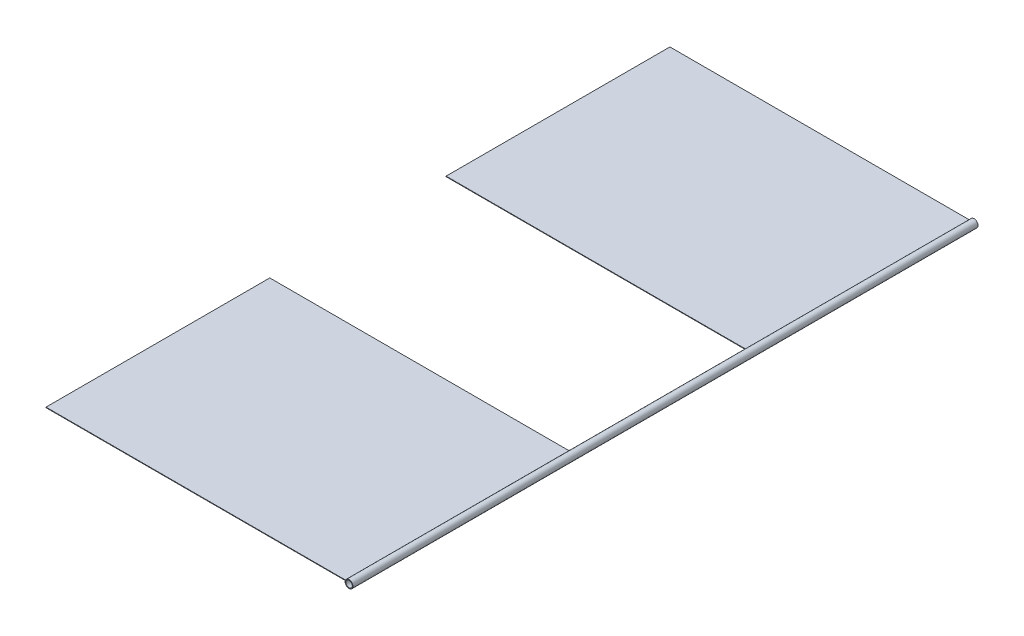
ISO-10303-21;
HEADER;
FILE_DESCRIPTION(('STEP AP214'),'2;1');
FILE_NAME('part.step','',(''),(''),'','','');
FILE_SCHEMA(('AUTOMOTIVE_DESIGN { 1 0 10303 214 1 1 1 1 }'));
ENDSEC;
DATA;
#1=APPLICATION_CONTEXT('core data for automotive mechanical design processes');
#2=APPLICATION_PROTOCOL_DEFINITION('international standard','automotive_design',2000,#1);
#3=PRODUCT_CONTEXT('',#1,'mechanical');
#4=PRODUCT('Part','Part','',(#3));
#5=PRODUCT_RELATED_PRODUCT_CATEGORY('part','',(#4));
#6=PRODUCT_DEFINITION_FORMATION('','',#4);
#7=PRODUCT_DEFINITION_CONTEXT('part definition',#1,'design');
#8=PRODUCT_DEFINITION('design','',#6,#7);
#9=PRODUCT_DEFINITION_SHAPE('','',#8);
#10=(LENGTH_UNIT() NAMED_UNIT(*) SI_UNIT(.MILLI.,.METRE.));
#11=(NAMED_UNIT(*) PLANE_ANGLE_UNIT() SI_UNIT($,.RADIAN.));
#12=(NAMED_UNIT(*) SI_UNIT($,.STERADIAN.) SOLID_ANGLE_UNIT());
#13=UNCERTAINTY_MEASURE_WITH_UNIT(LENGTH_MEASURE(1.E-05),#10,'distance_accuracy_value','');
#14=(GEOMETRIC_REPRESENTATION_CONTEXT(3) GLOBAL_UNCERTAINTY_ASSIGNED_CONTEXT((#13)) GLOBAL_UNIT_ASSIGNED_CONTEXT((#10,
#11,#12)) REPRESENTATION_CONTEXT('',''));
#15=CARTESIAN_POINT('',(0.,0.,0.));
#16=DIRECTION('',(0.,0.,1.));
#17=DIRECTION('',(1.,0.,0.));
#18=AXIS2_PLACEMENT_3D('',#15,#16,#17);
#19=CARTESIAN_POINT('',(0.,0.,3048.));
#20=DIRECTION('',(0.,0.,-1.));
#21=DIRECTION('',(-1.,0.,0.));
#22=AXIS2_PLACEMENT_3D('',#19,#20,#21);
#23=CYLINDRICAL_SURFACE('',#22,19.05);
#24=CARTESIAN_POINT('',(0.,0.,1951.07937136251));
#25=DIRECTION('',(0.,0.,1.));
#26=DIRECTION('',(1.,0.,0.));
#27=AXIS2_PLACEMENT_3D('',#24,#25,#26);
#28=CIRCLE('',#27,19.05);
#29=CARTESIAN_POINT('',(-18.8799073090945,2.54,1951.07937136251));
#30=VERTEX_POINT('',#29);
#31=CARTESIAN_POINT('',(-19.05,0.,1951.07937136251));
#32=VERTEX_POINT('',#31);
#33=EDGE_CURVE('E46',#30,#32,#28,.T.);
#34=ORIENTED_EDGE('',*,*,#33,.F.);
#35=DIRECTION('',(0.,0.,-1.));
#36=VECTOR('',#35,1.);
#37=CARTESIAN_POINT('',(-18.8799073090945,2.54,3048.));
#38=LINE('',#37,#36);
#39=CARTESIAN_POINT('',(-18.8799073090945,2.54,3042.28919320611));
#40=VERTEX_POINT('',#39);
#41=EDGE_CURVE('E11',#30,#40,#38,.F.);
#42=ORIENTED_EDGE('',*,*,#41,.T.);
#43=CARTESIAN_POINT('',(0.,0.,3042.28919320611));
#44=DIRECTION('',(0.,0.,-1.));
#45=DIRECTION('',(-1.,0.,0.));
#46=AXIS2_PLACEMENT_3D('',#43,#44,#45);
#47=CIRCLE('',#46,19.05);
#48=CARTESIAN_POINT('',(-19.05,0.,3042.28919320611));
#49=VERTEX_POINT('',#48);
#50=EDGE_CURVE('E127',#49,#40,#47,.T.);
#51=ORIENTED_EDGE('',*,*,#50,.F.);
#52=DIRECTION('',(0.,0.,-1.));
#53=VECTOR('',#52,1.);
#54=CARTESIAN_POINT('',(-19.05,0.,3048.));
#55=LINE('',#54,#53);
#56=EDGE_CURVE('E109',#32,#49,#55,.F.);
#57=ORIENTED_EDGE('',*,*,#56,.F.);
#58=EDGE_LOOP('',(#34,#42,#51,#57));
#59=FACE_BOUND('',#58,.T.);
#60=CARTESIAN_POINT('',(0.,0.,3048.));
#61=DIRECTION('',(0.,0.,1.));
#62=DIRECTION('',(1.,0.,0.));
#63=AXIS2_PLACEMENT_3D('',#60,#61,#62);
#64=CIRCLE('',#63,19.05);
#65=CARTESIAN_POINT('',(19.05,0.,3048.));
#66=VERTEX_POINT('',#65);
#67=EDGE_CURVE('E187',#66,#66,#64,.T.);
#68=ORIENTED_EDGE('',*,*,#67,.F.);
#69=EDGE_LOOP('',(#68));
#70=FACE_BOUND('',#69,.T.);
#71=CARTESIAN_POINT('',(-19.05,0.,1816.1));
#72=CARTESIAN_POINT('',(-19.0499999149557,0.319044351827431,1816.10000008211));
#73=CARTESIAN_POINT('',(-19.041968060588,0.638090286445415,1816.11203839982));
#74=CARTESIAN_POINT('',(-19.0100429113742,1.27357416889368,1816.16000197035));
#75=CARTESIAN_POINT('',(-18.9861495330445,1.59001210298844,1816.19592734888));
#76=CARTESIAN_POINT('',(-18.9230795112656,2.21792085178077,1816.29113481668));
#77=CARTESIAN_POINT('',(-18.8838969102271,2.52938968091534,1816.35042601075));
#78=CARTESIAN_POINT('',(-18.7911802647186,3.14498780586517,1816.49151590429));
#79=CARTESIAN_POINT('',(-18.7376460467142,3.44911701288401,1816.57331487591));
#80=CARTESIAN_POINT('',(-18.6177206611583,4.0466538013402,1816.75791049455));
#81=CARTESIAN_POINT('',(-18.551392136999,4.34010566223847,1816.86060496236));
#82=CARTESIAN_POINT('',(-18.4071052568794,4.9162149019322,1817.08605426698));
#83=CARTESIAN_POINT('',(-18.3291469610881,5.19887233656531,1817.20880900001));
#84=CARTESIAN_POINT('',(-18.1631367051315,5.7520743270185,1817.47314642421));
#85=CARTESIAN_POINT('',(-18.0750863641369,6.02262081626361,1817.61472609567));
#86=CARTESIAN_POINT('',(-17.890458352108,6.55074759818103,1817.91560225436));
#87=CARTESIAN_POINT('',(-17.7938775100723,6.80832301284097,1818.07490533558));
#88=CARTESIAN_POINT('',(-17.5854082661757,7.33086574145439,1818.42428914995));
#89=CARTESIAN_POINT('',(-17.4729161377666,7.59461321173181,1818.61583369295));
#90=CARTESIAN_POINT('',(-17.2420675803483,8.1050653025782,1819.01719120944));
#91=CARTESIAN_POINT('',(-17.1237109886304,8.35176944982761,1819.22700468992));
#92=CARTESIAN_POINT('',(-16.88319928241,8.82787123192332,1819.6641752971));
#93=CARTESIAN_POINT('',(-16.761038834922,9.05724286741385,1819.89155778368));
#94=CARTESIAN_POINT('',(-16.5154631225223,9.49765992068974,1820.36267666605));
#95=CARTESIAN_POINT('',(-16.3920481088713,9.7087089303321,1820.60640983986));
#96=CARTESIAN_POINT('',(-16.1269912795643,10.1438339769355,1821.14937546016));
#97=CARTESIAN_POINT('',(-15.9855513078686,10.3646977289021,1821.45129146347));
#98=CARTESIAN_POINT('',(-15.7084356410374,10.780069739996,1822.07537173626));
#99=CARTESIAN_POINT('',(-15.5727612595664,10.9745720146432,1822.39754057923));
#100=CARTESIAN_POINT('',(-15.3120771580104,11.3354426882506,1823.06066201176));
#101=CARTESIAN_POINT('',(-15.1870504300321,11.5018563882181,1823.401583157));
#102=CARTESIAN_POINT('',(-14.9525421661918,11.8051159191697,1824.1016331048));
#103=CARTESIAN_POINT('',(-14.8430611914587,11.9419606829467,1824.46076256395));
#104=CARTESIAN_POINT('',(-14.6737887971172,12.1488590280839,1825.08909158887));
#105=CARTESIAN_POINT('',(-14.6087779778263,12.2267886352653,1825.354312724));
#106=CARTESIAN_POINT('',(-14.4914306450492,12.365646341897,1825.8917796618));
#107=CARTESIAN_POINT('',(-14.4390859954183,12.4265853591446,1826.16402083011));
#108=CARTESIAN_POINT('',(-14.3488945218811,12.5306215699127,1826.71392215595));
#109=CARTESIAN_POINT('',(-14.3110297415314,12.5737408670082,1826.99157515004));
#110=CARTESIAN_POINT('',(-14.2511622433024,12.6415558604092,1827.55084231658));
#111=CARTESIAN_POINT('',(-14.2291596123525,12.6662514557472,1827.83245651072));
#112=CARTESIAN_POINT('',(-14.2018752005734,12.6968370696705,1828.39869661561));
#113=CARTESIAN_POINT('',(-14.196663038368,12.7026487905647,1828.68333016881));
#114=CARTESIAN_POINT('',(-14.2033816794799,12.6951357599989,1829.25213953647));
#115=CARTESIAN_POINT('',(-14.2153125410288,12.6818109435355,1829.53631534939));
#116=CARTESIAN_POINT('',(-14.2558189324114,12.6362591370599,1830.10214668239));
#117=CARTESIAN_POINT('',(-14.2844068298006,12.604018101965,1830.38380017175));
#118=CARTESIAN_POINT('',(-14.357069745187,12.5211847753434,1830.94234802377));
#119=CARTESIAN_POINT('',(-14.4011450585548,12.4705921338209,1831.21924229556));
#120=CARTESIAN_POINT('',(-14.5008617434375,12.3544761806585,1831.75440977541));
#121=CARTESIAN_POINT('',(-14.55590095007,12.289717714774,1832.012963225));
#122=CARTESIAN_POINT('',(-14.6769594426604,12.1448862980871,1832.5231831653));
#123=CARTESIAN_POINT('',(-14.742982278044,12.0648083954581,1832.77484739901));
#124=CARTESIAN_POINT('',(-14.8842370446745,11.8901049878849,1833.27039533264));
#125=CARTESIAN_POINT('',(-14.9594690117088,11.7954794264067,1833.51427900232));
#126=CARTESIAN_POINT('',(-15.1173998256832,11.5923798373339,1833.99369955338));
#127=CARTESIAN_POINT('',(-15.2000989778942,11.4839052434926,1834.22923609297));
#128=CARTESIAN_POINT('',(-15.3887310058595,11.2302825549988,1834.73863252709));
#129=CARTESIAN_POINT('',(-15.4959665818437,11.0821640136152,1835.01053379024));
#130=CARTESIAN_POINT('',(-15.7161179031399,10.7676822582034,1835.54107683918));
#131=CARTESIAN_POINT('',(-15.829033070871,10.6013208973392,1835.79971996786));
#132=CARTESIAN_POINT('',(-16.058224949471,10.2508438822787,1836.3036322006));
#133=CARTESIAN_POINT('',(-16.1745055279823,10.0667071827702,1836.54888489974));
#134=CARTESIAN_POINT('',(-16.4080174089175,9.68143701029365,1837.02518161231));
#135=CARTESIAN_POINT('',(-16.525248774024,9.48030240833241,1837.25622468019));
#136=CARTESIAN_POINT('',(-16.7837163834045,9.01633250153971,1837.75178685886));
#137=CARTESIAN_POINT('',(-16.9246742415276,8.74954821141177,1838.01277245872));
#138=CARTESIAN_POINT('',(-17.2012588585807,8.192431898865,1838.51153228265));
#139=CARTESIAN_POINT('',(-17.3368846334085,7.90209555963253,1838.74930223387));
#140=CARTESIAN_POINT('',(-17.5992409697553,7.29912570388169,1839.19972408662));
#141=CARTESIAN_POINT('',(-17.7259780204629,6.98650879659969,1839.41239439117));
#142=CARTESIAN_POINT('',(-17.9673044475892,6.34014069602103,1839.81075092457));
#143=CARTESIAN_POINT('',(-18.0818971641011,6.00639535429019,1839.99644457811));
#144=CARTESIAN_POINT('',(-18.2747724322506,5.38691504029946,1840.30505585161));
#145=CARTESIAN_POINT('',(-18.3557696171759,5.10459086222116,1840.4331440072));
#146=CARTESIAN_POINT('',(-18.5062654001564,4.52870423339783,1840.66918833697));
#147=CARTESIAN_POINT('',(-18.5757661520493,4.23514390044705,1840.77714828262));
#148=CARTESIAN_POINT('',(-18.7017836207441,3.63850093619614,1840.9716760582));
#149=CARTESIAN_POINT('',(-18.7583086014464,3.33542450604288,1841.05825750616));
#150=CARTESIAN_POINT('',(-18.8571698991357,2.72145399464525,1841.209012769));
#151=CARTESIAN_POINT('',(-18.8995059978573,2.41055979322043,1841.27318623918));
#152=CARTESIAN_POINT('',(-18.9691377632047,1.78179294641308,1841.37844405422));
#153=CARTESIAN_POINT('',(-18.996366833584,1.46389572546418,1841.41942618037));
#154=CARTESIAN_POINT('',(-19.034820707395,0.824941145729784,1841.47723814078));
#155=CARTESIAN_POINT('',(-19.0460454899143,0.503883782815549,1841.49406794348));
#156=CARTESIAN_POINT('',(-19.0522045898932,-0.138725107609701,1841.50330710086));
#157=CARTESIAN_POINT('',(-19.0471395787862,-0.460276614207039,1841.49571746206));
#158=CARTESIAN_POINT('',(-19.0208492602128,-1.1012052955868,1841.45624053424));
#159=CARTESIAN_POINT('',(-18.9996246424728,-1.42058256258338,1841.42435428226));
#160=CARTESIAN_POINT('',(-18.9436003211899,-2.03226782020847,1841.3398728559));
#161=CARTESIAN_POINT('',(-18.9098612177052,-2.32489890402019,1841.28889319921));
#162=CARTESIAN_POINT('',(-18.8295982615719,-2.90417350057285,1841.16702766058));
#163=CARTESIAN_POINT('',(-18.7830751285297,-3.19081734935519,1841.09614289908));
#164=CARTESIAN_POINT('',(-18.6781723632704,-3.75647970570794,1840.93529307264));
#165=CARTESIAN_POINT('',(-18.6197919592089,-4.03549771553518,1840.84532676557));
#166=CARTESIAN_POINT('',(-18.4922798141389,-4.58448654730647,1840.64726353582));
#167=CARTESIAN_POINT('',(-18.4231475004616,-4.85445688642161,1840.53916564739));
#168=CARTESIAN_POINT('',(-18.2708860160937,-5.40020940820447,1840.29878017363));
#169=CARTESIAN_POINT('',(-18.1871630742087,-5.6753550346633,1840.16542477122));
#170=CARTESIAN_POINT('',(-18.0105704184075,-6.21304645580799,1839.88064192214));
#171=CARTESIAN_POINT('',(-17.9177004292694,-6.47559187101721,1839.72921393167));
#172=CARTESIAN_POINT('',(-17.7244005810023,-6.98734375229446,1839.40934136869));
#173=CARTESIAN_POINT('',(-17.6239673585762,-7.2365441986886,1839.24088921418));
#174=CARTESIAN_POINT('',(-17.4172474675303,-7.72083737411981,1838.88803517288));
#175=CARTESIAN_POINT('',(-17.3109601468281,-7.95592852541664,1838.70363150796));
#176=CARTESIAN_POINT('',(-17.0771108634958,-8.44749054584707,1838.28941008815));
#177=CARTESIAN_POINT('',(-16.9488424778651,-8.70146366391877,1838.05702204661));
#178=CARTESIAN_POINT('',(-16.6895134170716,-9.18906491102775,1837.57320222587));
#179=CARTESIAN_POINT('',(-16.5584523739017,-9.42269033781795,1837.32176792552));
#180=CARTESIAN_POINT('',(-16.2963694707964,-9.86903539048537,1836.80062047575));
#181=CARTESIAN_POINT('',(-16.1653476979282,-10.0817407099855,1836.53089502784));
#182=CARTESIAN_POINT('',(-15.9065761047636,-10.4852645071189,1835.97408053075));
#183=CARTESIAN_POINT('',(-15.7788259513027,-10.6760852203044,1835.68699325968));
#184=CARTESIAN_POINT('',(-15.5405469624032,-11.0197028233681,1835.12109654466));
#185=CARTESIAN_POINT('',(-15.4294753422067,-11.1743505461839,1834.84363978613));
#186=CARTESIAN_POINT('',(-15.2158323601735,-11.4635626931767,1834.27525270262));
#187=CARTESIAN_POINT('',(-15.1132611214873,-11.598126826412,1833.98432218252));
#188=CARTESIAN_POINT('',(-14.9199086044728,-11.8458215660013,1833.39020000616));
#189=CARTESIAN_POINT('',(-14.8291101392458,-11.9589835304227,1833.08702709072));
#190=CARTESIAN_POINT('',(-14.6624415509891,-12.1627572627768,1832.46920450079));
#191=CARTESIAN_POINT('',(-14.5865679980102,-12.2533742131333,1832.15455748297));
#192=CARTESIAN_POINT('',(-14.465008524996,-12.3964989415322,1831.57302325677));
#193=CARTESIAN_POINT('',(-14.4163477325549,-12.4529292409067,1831.30772028903));
#194=CARTESIAN_POINT('',(-14.332868782449,-12.5489216869189,1830.77195047985));
#195=CARTESIAN_POINT('',(-14.298047826653,-12.5884872433793,1830.50148469383));
#196=CARTESIAN_POINT('',(-14.2435454437137,-12.650123129829,1829.9572819106));
#197=CARTESIAN_POINT('',(-14.2238506830906,-12.672208868501,1829.68354801088));
#198=CARTESIAN_POINT('',(-14.2003241372728,-12.6985673478657,1829.13453005678));
#199=CARTESIAN_POINT('',(-14.1964925835845,-12.7028398285932,1828.85924597982));
#200=CARTESIAN_POINT('',(-14.2048515662274,-12.6934916088717,1828.3090717932));
#201=CARTESIAN_POINT('',(-14.2170512489474,-12.6798606939025,1828.03418199808));
#202=CARTESIAN_POINT('',(-14.2569974195233,-12.6349285104012,1827.4870088376));
#203=CARTESIAN_POINT('',(-14.2847437799291,-12.6036273867273,1827.21472545089));
#204=CARTESIAN_POINT('',(-14.3547629579246,-12.523820828058,1826.67429808478));
#205=CARTESIAN_POINT('',(-14.3970516246548,-12.4752966203751,1826.40615895663));
#206=CARTESIAN_POINT('',(-14.4946700634275,-12.3617406007917,1825.87579797369));
#207=CARTESIAN_POINT('',(-14.5500027276897,-12.2967051276345,1825.61357744536));
#208=CARTESIAN_POINT('',(-14.68823700132,-12.1314748725769,1825.02731786569));
#209=CARTESIAN_POINT('',(-14.7745561243192,-12.0265291636104,1824.70541790969));
#210=CARTESIAN_POINT('',(-14.9616336605759,-11.7929800056362,1824.07466242066));
#211=CARTESIAN_POINT('',(-15.0623960523769,-11.6643700352921,1823.76581051231));
#212=CARTESIAN_POINT('',(-15.2748294262098,-11.3847676985938,1823.1619240366));
#213=CARTESIAN_POINT('',(-15.3865120243571,-11.2337514077466,1822.86690468769));
#214=CARTESIAN_POINT('',(-15.6173044629006,-10.9106240233758,1822.29176753891));
#215=CARTESIAN_POINT('',(-15.7364139108891,-10.7385140439026,1822.01164895317));
#216=CARTESIAN_POINT('',(-15.9811861487097,-10.3708171200094,1821.46191578552));
#217=CARTESIAN_POINT('',(-16.106928640749,-10.1748607935095,1821.19258409512));
#218=CARTESIAN_POINT('',(-16.3599595377092,-9.76282141905092,1820.6705538291));
#219=CARTESIAN_POINT('',(-16.4872479909,-9.54673774123848,1820.41785577442));
#220=CARTESIAN_POINT('',(-16.740663909855,-9.09503982204104,1819.92977832163));
#221=CARTESIAN_POINT('',(-16.8667910528357,-8.8594203225647,1819.69440361852));
#222=CARTESIAN_POINT('',(-17.115274873323,-8.36931136011985,1819.24197388725));
#223=CARTESIAN_POINT('',(-17.2376312364539,-8.11482032979561,1819.02492038396));
#224=CARTESIAN_POINT('',(-17.493254792792,-7.54970254155806,1818.58045424613));
#225=CARTESIAN_POINT('',(-17.6255602874115,-7.23626632101131,1818.35604144845));
#226=CARTESIAN_POINT('',(-17.878414796885,-6.58682136636565,1817.93475286991));
#227=CARTESIAN_POINT('',(-17.9989620969693,-6.25080935193142,1817.73788110371));
#228=CARTESIAN_POINT('',(-18.2246695158514,-5.55844604424605,1817.37431137177));
#229=CARTESIAN_POINT('',(-18.3298484880972,-5.20212043039754,1817.20757637448));
#230=CARTESIAN_POINT('',(-18.5216848308935,-4.47127050263202,1816.90656600974));
#231=CARTESIAN_POINT('',(-18.6083487044846,-4.09675263527621,1816.77227924336));
#232=CARTESIAN_POINT('',(-18.7433618107449,-3.41771005618145,1816.56456584783));
#233=CARTESIAN_POINT('',(-18.7959457294468,-3.11611666400264,1816.48424630446));
#234=CARTESIAN_POINT('',(-18.8869925507734,-2.50581917645865,1816.34573477294));
#235=CARTESIAN_POINT('',(-18.9254581509337,-2.1971164514393,1816.28753855769));
#236=CARTESIAN_POINT('',(-18.9873565441207,-1.57494955676608,1816.19411121625));
#237=CARTESIAN_POINT('',(-19.0107983807472,-1.26148836804532,1816.15886627427));
#238=CARTESIAN_POINT('',(-19.0421204426587,-0.63201870055981,1816.11181018599));
#239=CARTESIAN_POINT('',(-19.0500000842355,-0.31601012669386,1816.09999991868));
#240=CARTESIAN_POINT('',(-19.05,0.,1816.1));
#241=B_SPLINE_CURVE_WITH_KNOTS('',3,(#71,#72,#73,#74,#75,#76,#77,#78,#79,#80,#81,#82,#83,#84,
#85,#86,#87,#88,#89,#90,#91,#92,#93,#94,#95,#96,#97,#98,#99,#100,#101,#102,#103,#104,#105,#106,
#107,#108,#109,#110,#111,#112,#113,#114,#115,#116,#117,#118,#119,#120,#121,#122,#123,#124,#125,
#126,#127,#128,#129,#130,#131,#132,#133,#134,#135,#136,#137,#138,#139,#140,#141,#142,#143,#144,
#145,#146,#147,#148,#149,#150,#151,#152,#153,#154,#155,#156,#157,#158,#159,#160,#161,#162,#163,
#164,#165,#166,#167,#168,#169,#170,#171,#172,#173,#174,#175,#176,#177,#178,#179,#180,#181,#182,
#183,#184,#185,#186,#187,#188,#189,#190,#191,#192,#193,#194,#195,#196,#197,#198,#199,#200,#201,
#202,#203,#204,#205,#206,#207,#208,#209,#210,#211,#212,#213,#214,#215,#216,#217,#218,#219,#220,
#221,#222,#223,#224,#225,#226,#227,#228,#229,#230,#231,#232,#233,#234,#235,#236,#237,#238,#239,
#240),.UNSPECIFIED.,.T.,.F.,(4,2,2,2,2,2,2,2,2,2,2,2,2,2,2,2,2,2,2,2,2,2,2,2,2,2,2,2,2,2,2,2,2,
2,2,2,2,2,2,2,2,2,2,2,2,2,2,2,2,2,2,2,2,2,2,2,2,2,2,2,2,2,2,2,2,2,2,2,2,2,2,2,2,2,2,2,2,2,2,2,2,
2,2,2,4),(0.,0.956810761235854,1.91362655847807,2.87081556090177,3.82801613781664,
4.7806438734543,5.73326668065101,6.68573686214544,7.6385626029103,8.67204187918502,
9.70554984525706,10.7405785398535,11.7754038733454,12.9737687791915,14.1724052791263,
15.3690897640792,16.5658174327631,17.4169624050965,18.2675591823319,19.1170976896833,
19.96664085273,20.8197019883413,21.6727660216504,22.5264642485428,23.3801787577412,
24.1958922150155,25.0118697888846,25.8278505338162,26.6438646525221,27.6259849439917,
28.6080055607961,29.5912034548522,30.5744667038788,31.7698891917547,32.9655312837396,
34.1602912133792,35.3547216870893,36.3150486115988,37.2751954161728,38.234729023431,
39.1942773903639,40.1580227862106,41.1217694413607,42.0854763732661,43.0491421744252,
43.9449821115542,44.8407716326455,45.7366194835051,46.6325150654029,47.5826127907217,
48.5327391119045,49.4832904688685,50.4339479218129,51.5349337140494,52.6360654989427,
53.7379451405191,54.8397121226409,55.8483172040234,56.8569368951844,57.8640671281831,
58.8709656377502,59.6968309869368,60.5225292780425,61.3474988923451,62.1724805461416,
62.997933085649,63.8233788582884,64.6497271210522,65.4762587810048,66.5229575872962,
67.5699452733477,68.6180590415175,69.666117478024,70.7331964759543,71.8003088776718,
72.86770943226,73.935198738218,75.1562166249855,76.3774123148768,77.5970970650057,
78.8163527195605,79.7647809704503,80.7130279141584,81.6607035202976,82.6084146712655),.UNSPECIFIED.);
#242=CARTESIAN_POINT('',(-19.05,0.,1816.1));
#243=VERTEX_POINT('',#242);
#244=EDGE_CURVE('E156',#243,#243,#241,.T.);
#245=ORIENTED_EDGE('',*,*,#244,.T.);
#246=EDGE_LOOP('',(#245));
#247=FACE_BOUND('',#246,.T.);
#248=DIRECTION('',(0.,0.,-1.));
#249=VECTOR('',#248,1.);
#250=CARTESIAN_POINT('',(-18.8799073090945,2.54,3048.));
#251=LINE('',#250,#249);
#252=CARTESIAN_POINT('',(-18.8799073090945,2.54,1091.20982184359));
#253=VERTEX_POINT('',#252);
#254=CARTESIAN_POINT('',(-18.8799073090945,2.54,0.));
#255=VERTEX_POINT('',#254);
#256=EDGE_CURVE('E40',#253,#255,#251,.T.);
#257=ORIENTED_EDGE('',*,*,#256,.F.);
#258=CARTESIAN_POINT('',(0.,0.,1091.20982184359));
#259=DIRECTION('',(0.,0.,-1.));
#260=DIRECTION('',(-1.,0.,0.));
#261=AXIS2_PLACEMENT_3D('',#258,#259,#260);
#262=CIRCLE('',#261,19.05);
#263=CARTESIAN_POINT('',(-19.05,0.,1091.20982184359));
#264=VERTEX_POINT('',#263);
#265=EDGE_CURVE('E153',#264,#253,#262,.T.);
#266=ORIENTED_EDGE('',*,*,#265,.F.);
#267=DIRECTION('',(0.,0.,-1.));
#268=VECTOR('',#267,1.);
#269=CARTESIAN_POINT('',(-19.05,0.,3048.));
#270=LINE('',#269,#268);
#271=CARTESIAN_POINT('',(-19.05,0.,0.));
#272=VERTEX_POINT('',#271);
#273=EDGE_CURVE('E150',#264,#272,#270,.T.);
#274=ORIENTED_EDGE('',*,*,#273,.T.);
#275=CARTESIAN_POINT('',(0.,0.,0.));
#276=DIRECTION('',(0.,0.,1.));
#277=DIRECTION('',(1.,0.,0.));
#278=AXIS2_PLACEMENT_3D('',#275,#276,#277);
#279=CIRCLE('',#278,19.05);
#280=EDGE_CURVE('E185',#272,#255,#279,.T.);
#281=ORIENTED_EDGE('',*,*,#280,.T.);
#282=EDGE_LOOP('',(#257,#266,#274,#281));
#283=FACE_BOUND('',#282,.T.);
#284=ADVANCED_FACE('F32',(#59,#70,#247,#283),#23,.T.);
#285=CARTESIAN_POINT('',(0.,0.,3048.));
#286=DIRECTION('',(0.,0.,1.));
#287=DIRECTION('',(1.,0.,0.));
#288=AXIS2_PLACEMENT_3D('',#285,#286,#287);
#289=PLANE('',#288);
#290=ORIENTED_EDGE('',*,*,#67,.T.);
#291=EDGE_LOOP('',(#290));
#292=FACE_BOUND('',#291,.T.);
#293=CARTESIAN_POINT('',(0.,0.,3048.));
#294=DIRECTION('',(0.,0.,1.));
#295=DIRECTION('',(1.,0.,0.));
#296=AXIS2_PLACEMENT_3D('',#293,#294,#295);
#297=CIRCLE('',#296,15.875);
#298=CARTESIAN_POINT('',(15.875,0.,3048.));
#299=VERTEX_POINT('',#298);
#300=EDGE_CURVE('E164',#299,#299,#297,.T.);
#301=ORIENTED_EDGE('',*,*,#300,.F.);
#302=EDGE_LOOP('',(#301));
#303=FACE_BOUND('',#302,.T.);
#304=ADVANCED_FACE('F202',(#292,#303),#289,.T.);
#305=CARTESIAN_POINT('',(0.,0.,0.));
#306=DIRECTION('',(0.,0.,1.));
#307=DIRECTION('',(1.,0.,0.));
#308=AXIS2_PLACEMENT_3D('',#305,#306,#307);
#309=PLANE('',#308);
#310=CARTESIAN_POINT('',(0.,0.,0.));
#311=DIRECTION('',(0.,0.,1.));
#312=DIRECTION('',(1.,0.,0.));
#313=AXIS2_PLACEMENT_3D('',#310,#311,#312);
#314=CIRCLE('',#313,15.875);
#315=CARTESIAN_POINT('',(15.875,0.,0.));
#316=VERTEX_POINT('',#315);
#317=EDGE_CURVE('E163',#316,#316,#314,.T.);
#318=ORIENTED_EDGE('',*,*,#317,.T.);
#319=EDGE_LOOP('',(#318));
#320=FACE_BOUND('',#319,.T.);
#321=DIRECTION('',(-1.,0.,0.));
#322=VECTOR('',#321,1.);
#323=CARTESIAN_POINT('',(-15.875,2.54,0.));
#324=LINE('',#323,#322);
#325=CARTESIAN_POINT('',(-1483.45573796439,2.54,0.));
#326=VERTEX_POINT('',#325);
#327=EDGE_CURVE('E131',#255,#326,#324,.T.);
#328=ORIENTED_EDGE('',*,*,#327,.F.);
#329=ORIENTED_EDGE('',*,*,#280,.F.);
#330=DIRECTION('',(-1.,0.,0.));
#331=VECTOR('',#330,1.);
#332=CARTESIAN_POINT('',(-15.875,0.,0.));
#333=LINE('',#332,#331);
#334=CARTESIAN_POINT('',(-1483.45573796439,0.,0.));
#335=VERTEX_POINT('',#334);
#336=EDGE_CURVE('E130',#272,#335,#333,.T.);
#337=ORIENTED_EDGE('',*,*,#336,.T.);
#338=DIRECTION('',(0.,-1.,0.));
#339=VECTOR('',#338,1.);
#340=CARTESIAN_POINT('',(-1483.45573796439,2.54,0.));
#341=LINE('',#340,#339);
#342=EDGE_CURVE('E147',#326,#335,#341,.T.);
#343=ORIENTED_EDGE('',*,*,#342,.F.);
#344=EDGE_LOOP('',(#328,#329,#337,#343));
#345=FACE_BOUND('',#344,.T.);
#346=ADVANCED_FACE('F204',(#320,#345),#309,.F.);
#347=CARTESIAN_POINT('',(0.,0.,3048.));
#348=DIRECTION('',(0.,0.,-1.));
#349=DIRECTION('',(-1.,0.,0.));
#350=AXIS2_PLACEMENT_3D('',#347,#348,#349);
#351=CYLINDRICAL_SURFACE('',#350,15.875);
#352=ORIENTED_EDGE('',*,*,#317,.F.);
#353=EDGE_LOOP('',(#352));
#354=FACE_BOUND('',#353,.T.);
#355=CARTESIAN_POINT('',(-15.875,0.,1841.5));
#356=CARTESIAN_POINT('',(-15.874997577373,-0.304946678408362,1841.49999751546));
#357=CARTESIAN_POINT('',(-15.8661933313083,-0.609940256039709,1841.4889969478));
#358=CARTESIAN_POINT('',(-15.8311732111849,-1.21747713996693,1841.44518047568));
#359=CARTESIAN_POINT('',(-15.8049481227586,-1.52001906375071,1841.41235302638));
#360=CARTESIAN_POINT('',(-15.7356292600999,-2.12065102334586,1841.32537800977));
#361=CARTESIAN_POINT('',(-15.6925032433047,-2.41873141252235,1841.27118969034));
#362=CARTESIAN_POINT('',(-15.590356696802,-3.00760934021386,1841.1424119433));
#363=CARTESIAN_POINT('',(-15.5313379403389,-3.29840768727423,1841.0678247917));
#364=CARTESIAN_POINT('',(-15.3990641395143,-3.86906959192731,1840.89992588308));
#365=CARTESIAN_POINT('',(-15.3259027742938,-4.14899129296072,1840.80673721486));
#366=CARTESIAN_POINT('',(-15.1664928825069,-4.69839855430967,1840.60258223973));
#367=CARTESIAN_POINT('',(-15.0802442741036,-4.96788404935239,1840.49161582165));
#368=CARTESIAN_POINT('',(-14.8961691050621,-5.49524841470711,1840.25320776912));
#369=CARTESIAN_POINT('',(-14.7983454387945,-5.75313016439509,1840.12577025257));
#370=CARTESIAN_POINT('',(-14.5926211266804,-6.25659857364943,1839.85561521953));
#371=CARTESIAN_POINT('',(-14.4847184202421,-6.5021827032168,1839.71289457762));
#372=CARTESIAN_POINT('',(-14.2212954576489,-7.06379319521991,1839.36113505323));
#373=CARTESIAN_POINT('',(-14.0622771763875,-7.37457237616273,1839.14630799067));
#374=CARTESIAN_POINT('',(-13.7324350357982,-7.9719735898551,1838.69334435243));
#375=CARTESIAN_POINT('',(-13.5616074107762,-8.25858785176858,1838.4552003314));
#376=CARTESIAN_POINT('',(-13.2114362349413,-8.80794766725585,1837.95685342205));
#377=CARTESIAN_POINT('',(-13.0320712876853,-9.07062785966297,1837.69659367119));
#378=CARTESIAN_POINT('',(-12.6691256086766,-9.57101847600507,1837.15591402747));
#379=CARTESIAN_POINT('',(-12.4855453584588,-9.80873173491317,1836.87549642963));
#380=CARTESIAN_POINT('',(-12.1154170639607,-10.262520531658,1836.29064843324));
#381=CARTESIAN_POINT('',(-11.9288675290395,-10.4781992973684,1835.98591095662));
#382=CARTESIAN_POINT('',(-11.5605858255579,-10.8831695998756,1835.35642941501));
#383=CARTESIAN_POINT('',(-11.3788551945832,-11.07245279467,1835.03167907174));
#384=CARTESIAN_POINT('',(-11.0267876923303,-11.4230949312855,1834.36282532393));
#385=CARTESIAN_POINT('',(-10.8564207625562,-11.584529491996,1834.01877779967));
#386=CARTESIAN_POINT('',(-10.5342528672376,-11.8782406284371,1833.31047798518));
#387=CARTESIAN_POINT('',(-10.3824360894565,-12.0105421156109,1832.94624329309));
#388=CARTESIAN_POINT('',(-10.0860255233748,-12.2609502301358,1832.1409419567));
#389=CARTESIAN_POINT('',(-9.94590029857922,-12.3739822665681,1831.69652698172));
#390=CARTESIAN_POINT('',(-9.77632497404288,-12.5077685491711,1831.01349295732));
#391=CARTESIAN_POINT('',(-9.72659169933265,-12.5463874066264,1830.78326628399));
#392=CARTESIAN_POINT('',(-9.64252902120905,-12.6111097368224,1830.31821018733));
#393=CARTESIAN_POINT('',(-9.60819943011355,-12.6372133620518,1830.08338082012));
#394=CARTESIAN_POINT('',(-9.55632598629638,-12.676487788426,1829.6086369969));
#395=CARTESIAN_POINT('',(-9.53893517157757,-12.6895407068896,1829.36869583693));
#396=CARTESIAN_POINT('',(-9.52237455445046,-12.7019730651629,1828.88783166807));
#397=CARTESIAN_POINT('',(-9.52320385295092,-12.7013531796719,1828.64690870822));
#398=CARTESIAN_POINT('',(-9.54304635018722,-12.6864510417178,1828.16607359597));
#399=CARTESIAN_POINT('',(-9.56207274105122,-12.6721588774247,1827.92616230374));
#400=CARTESIAN_POINT('',(-9.61734609800054,-12.6302598416231,1827.44951600755));
#401=CARTESIAN_POINT('',(-9.65359547155675,-12.6026511086836,1827.2127814524));
#402=CARTESIAN_POINT('',(-9.74851742136472,-12.5294118697669,1826.70743865822));
#403=CARTESIAN_POINT('',(-9.80981014988199,-12.4816382149724,1826.43963558865));
#404=CARTESIAN_POINT('',(-9.94992273330027,-12.3702320643351,1825.91207481874));
#405=CARTESIAN_POINT('',(-10.0287463708049,-12.3065961455701,1825.65231886852));
#406=CARTESIAN_POINT('',(-10.2007400930585,-12.164414814159,1825.14109438773));
#407=CARTESIAN_POINT('',(-10.2939451436956,-12.0858329517355,1824.88964791942));
#408=CARTESIAN_POINT('',(-10.4914007945583,-11.9148315022642,1824.3960207323));
#409=CARTESIAN_POINT('',(-10.5956522775735,-11.8224108090247,1824.15384075614));
#410=CARTESIAN_POINT('',(-10.8656452878139,-11.5758866538449,1823.5620464745));
#411=CARTESIAN_POINT('',(-11.0364477212272,-11.4137761571932,1823.21805942139));
#412=CARTESIAN_POINT('',(-11.3888481317534,-11.062180018169,1822.55014468567));
#413=CARTESIAN_POINT('',(-11.5704510753393,-10.8726817236955,1822.2262263734));
#414=CARTESIAN_POINT('',(-11.938648969819,-10.4670632421005,1821.59787855928));
#415=CARTESIAN_POINT('',(-12.1252495067597,-10.2509122011904,1821.29347227614));
#416=CARTESIAN_POINT('',(-12.4982409972812,-9.79269564292248,1820.70480395362));
#417=CARTESIAN_POINT('',(-12.6846319802469,-9.55063438695696,1820.42053861445));
#418=CARTESIAN_POINT('',(-13.0578441998884,-9.03396923050777,1819.86551879912));
#419=CARTESIAN_POINT('',(-13.2445431943892,-8.75866725097088,1819.59533028264));
#420=CARTESIAN_POINT('',(-13.6088599474268,-8.18114501817271,1819.07842444053));
#421=CARTESIAN_POINT('',(-13.7864763647762,-7.87892080737851,1818.83171057671));
#422=CARTESIAN_POINT('',(-14.1279475031631,-7.24878360602093,1818.36455054978));
#423=CARTESIAN_POINT('',(-14.2918328053373,-6.92093102408287,1818.14404553075));
#424=CARTESIAN_POINT('',(-14.6019884722185,-6.23998049869074,1817.73153484457));
#425=CARTESIAN_POINT('',(-14.7482667808475,-5.88689405571889,1817.53951631573));
#426=CARTESIAN_POINT('',(-14.9800275385174,-5.26225278489963,1817.23790589916));
#427=CARTESIAN_POINT('',(-15.070897501619,-4.996444915605,1817.12048845873));
#428=CARTESIAN_POINT('',(-15.2400320119973,-4.45395465520601,1816.90304132251));
#429=CARTESIAN_POINT('',(-15.3182996879689,-4.17727498446483,1816.80300731054));
#430=CARTESIAN_POINT('',(-15.4607707934912,-3.61447195303063,1816.6216192755));
#431=CARTESIAN_POINT('',(-15.5249812110129,-3.32835336626659,1816.5402559701));
#432=CARTESIAN_POINT('',(-15.638102237553,-2.74821885639619,1816.39731774978));
#433=CARTESIAN_POINT('',(-15.6870124489266,-2.45420272825218,1816.33574334915));
#434=CARTESIAN_POINT('',(-15.7686854465922,-1.858751280321,1816.23310745355));
#435=CARTESIAN_POINT('',(-15.8013615722344,-1.55728497388135,1816.19215603248));
#436=CARTESIAN_POINT('',(-15.849419579856,-0.950812405130005,1816.1319770677));
#437=CARTESIAN_POINT('',(-15.8648014907225,-0.645806148732061,1816.11274948772));
#438=CARTESIAN_POINT('',(-15.8779014160869,-0.0348642398974627,1816.09637246863));
#439=CARTESIAN_POINT('',(-15.8756219300206,0.271071274905345,1816.09921990547));
#440=CARTESIAN_POINT('',(-15.8534588686467,0.881287902047056,1816.1269339468));
#441=CARTESIAN_POINT('',(-15.8335761936197,1.18556909819214,1816.15179942522));
#442=CARTESIAN_POINT('',(-15.7789984949279,1.76540064594904,1816.22019267683));
#443=CARTESIAN_POINT('',(-15.7456369955862,2.0412780647173,1816.26204154242));
#444=CARTESIAN_POINT('',(-15.665109040232,2.58771032088221,1816.36332199323));
#445=CARTESIAN_POINT('',(-15.6179434776458,2.85826550153562,1816.42275244055));
#446=CARTESIAN_POINT('',(-15.5106583287494,3.39254641316052,1816.5584061891));
#447=CARTESIAN_POINT('',(-15.4505362065969,3.65627079588164,1816.63463277772));
#448=CARTESIAN_POINT('',(-15.3183657070138,4.17553455360426,1816.80294133064));
#449=CARTESIAN_POINT('',(-15.2463166695181,4.43107347466733,1816.89502417248));
#450=CARTESIAN_POINT('',(-15.0866529321877,4.94835701794528,1817.10017631716));
#451=CARTESIAN_POINT('',(-14.9983531018736,5.20951546128407,1817.21418851101));
#452=CARTESIAN_POINT('',(-14.8109761888022,5.72055257441234,1817.45780213884));
#453=CARTESIAN_POINT('',(-14.7118947481988,5.9704266249613,1817.58740987867));
#454=CARTESIAN_POINT('',(-14.5044721605462,6.45802479405771,1817.86098531738));
#455=CARTESIAN_POINT('',(-14.3961342446701,6.69575310640774,1818.00494800825));
#456=CARTESIAN_POINT('',(-14.1716111753515,7.15871987604556,1818.30623853531));
#457=CARTESIAN_POINT('',(-14.0554249472176,7.38395661510607,1818.46356820264));
#458=CARTESIAN_POINT('',(-13.7940645697839,7.86303164748508,1818.82160911668));
#459=CARTESIAN_POINT('',(-13.647563813091,8.11422305881244,1819.02489754558));
#460=CARTESIAN_POINT('',(-13.3479242119324,8.59823116839447,1819.44779543774));
#461=CARTESIAN_POINT('',(-13.1947846103415,8.83104576228451,1819.66740676459));
#462=CARTESIAN_POINT('',(-12.8839022841864,9.27874690133034,1820.12261259332));
#463=CARTESIAN_POINT('',(-12.7261481237306,9.49358271322594,1820.35824913452));
#464=CARTESIAN_POINT('',(-12.4090345784904,9.90448653437401,1820.84434529417));
#465=CARTESIAN_POINT('',(-12.2496750751148,10.1005531456875,1821.0948060145));
#466=CARTESIAN_POINT('',(-11.898282159399,10.5135528372193,1821.66527255013));
#467=CARTESIAN_POINT('',(-11.706533562965,10.7260095611718,1821.98871313614));
#468=CARTESIAN_POINT('',(-11.3306415398357,11.1223556700041,1822.65717798825));
#469=CARTESIAN_POINT('',(-11.146502185271,11.3062299005032,1823.00221356893));
#470=CARTESIAN_POINT('',(-10.7939325356037,11.6432760906934,1823.7129264758));
#471=CARTESIAN_POINT('',(-10.6254491619359,11.7965539751739,1824.07852676508));
#472=CARTESIAN_POINT('',(-10.3129620091018,12.0706921526851,1824.83156166211));
#473=CARTESIAN_POINT('',(-10.1689281158874,12.1915924323627,1825.21896861575));
#474=CARTESIAN_POINT('',(-9.97501858225641,12.3499941726961,1825.83072923597));
#475=CARTESIAN_POINT('',(-9.9123696998798,12.4002315732213,1826.04780048471));
#476=CARTESIAN_POINT('',(-9.799438472532,12.4896683580782,1826.48733214864));
#477=CARTESIAN_POINT('',(-9.74915111408893,12.5288722182286,1826.70979033868));
#478=CARTESIAN_POINT('',(-9.66286672759358,12.59553948146,1827.15873046254));
#479=CARTESIAN_POINT('',(-9.62683992786815,12.6230273532485,1827.38520297118));
#480=CARTESIAN_POINT('',(-9.57045641501688,12.6658301367697,1827.84125814139));
#481=CARTESIAN_POINT('',(-9.55009959722236,12.6811451298121,1828.07084078217));
#482=CARTESIAN_POINT('',(-9.52594684638101,12.6992991565702,1828.53264061794));
#483=CARTESIAN_POINT('',(-9.52224190496063,12.7020696433641,1828.76486535307));
#484=CARTESIAN_POINT('',(-9.53182425962133,12.6948802261924,1829.22875543285));
#485=CARTESIAN_POINT('',(-9.54511126064813,12.6849205432781,1829.46042078713));
#486=CARTESIAN_POINT('',(-9.58806046021321,12.6524873721714,1829.92164549832));
#487=CARTESIAN_POINT('',(-9.61774510401347,12.6299967311095,1830.15120152914));
#488=CARTESIAN_POINT('',(-9.69216225956389,12.5729788396096,1830.60633269742));
#489=CARTESIAN_POINT('',(-9.73689709644291,12.5384497292989,1830.83190721412));
#490=CARTESIAN_POINT('',(-9.85373460854039,12.4469453592654,1831.33907564075));
#491=CARTESIAN_POINT('',(-9.92997795162885,12.3864116765363,1831.61907430203));
#492=CARTESIAN_POINT('',(-10.0999691950352,12.2481923852874,1832.16932474553));
#493=CARTESIAN_POINT('',(-10.1937228589595,12.1705011277286,1832.4395732834));
#494=CARTESIAN_POINT('',(-10.3950472597568,11.9990053841556,1832.97035344173));
#495=CARTESIAN_POINT('',(-10.5026507831029,11.9051624789836,1833.23086004852));
#496=CARTESIAN_POINT('',(-10.7280159748949,11.7024907085427,1833.74137079475));
#497=CARTESIAN_POINT('',(-10.8457780436826,11.5936612525627,1833.9913745197));
#498=CARTESIAN_POINT('',(-11.1435931232857,11.3090850631596,1834.59222146369));
#499=CARTESIAN_POINT('',(-11.3276582403776,11.1253860442324,1834.93732923199));
#500=CARTESIAN_POINT('',(-11.7035758817969,10.729241724353,1835.60621143969));
#501=CARTESIAN_POINT('',(-11.8954315512299,10.5167847311744,1835.92997712193));
#502=CARTESIAN_POINT('',(-12.2811620495438,10.0636628337186,1836.55643205208));
#503=CARTESIAN_POINT('',(-12.4750386262887,9.82297127640208,1836.85910094828));
#504=CARTESIAN_POINT('',(-12.8595507170037,9.31393241288623,1837.44236357431));
#505=CARTESIAN_POINT('',(-13.0501867377499,9.04558947818716,1837.72296078119));
#506=CARTESIAN_POINT('',(-13.4261593651774,8.47769837691149,1838.26438292798));
#507=CARTESIAN_POINT('',(-13.6113925362032,8.17778443457071,1838.52489728057));
#508=CARTESIAN_POINT('',(-13.9693450754676,7.55007024437183,1839.01989119125));
#509=CARTESIAN_POINT('',(-14.1420623649023,7.22226538358762,1839.25436642784));
#510=CARTESIAN_POINT('',(-14.4699812896575,6.5404908371936,1839.69385462672));
#511=CARTESIAN_POINT('',(-14.6252242709725,6.18658633966084,1839.89893746293));
#512=CARTESIAN_POINT('',(-14.9140221714582,5.45366365285457,1840.27681458185));
#513=CARTESIAN_POINT('',(-15.0475903577533,5.07466102771858,1840.4496286261));
#514=CARTESIAN_POINT('',(-15.2492021285264,4.42189355517025,1840.70868568616));
#515=CARTESIAN_POINT('',(-15.3243975998441,4.15419225001261,1840.8047678688));
#516=CARTESIAN_POINT('',(-15.4616586999105,3.60990702456752,1840.9794989691));
#517=CARTESIAN_POINT('',(-15.5237278110024,3.33332548263642,1841.05815251074));
#518=CARTESIAN_POINT('',(-15.6334644268159,2.7733816647819,1841.19682930146));
#519=CARTESIAN_POINT('',(-15.6811628353449,2.49003537416336,1841.25689253622));
#520=CARTESIAN_POINT('',(-15.7613654907326,1.91790207054058,1841.35770495269));
#521=CARTESIAN_POINT('',(-15.793876501092,1.62911753910513,1841.39846273194));
#522=CARTESIAN_POINT('',(-15.8372262104826,1.1168934743691,1841.45275867437));
#523=CARTESIAN_POINT('',(-15.8513728529898,0.894161916844837,1841.47045568213));
#524=CARTESIAN_POINT('',(-15.870261683122,0.447628812993121,1841.49407856634));
#525=CARTESIAN_POINT('',(-15.8750017781779,0.223827039683975,1841.50000182362));
#526=CARTESIAN_POINT('',(-15.875,0.,1841.5));
#527=B_SPLINE_CURVE_WITH_KNOTS('',3,(#355,#356,#357,#358,#359,#360,#361,#362,#363,#364,#365,
#366,#367,#368,#369,#370,#371,#372,#373,#374,#375,#376,#377,#378,#379,#380,#381,#382,#383,#384,
#385,#386,#387,#388,#389,#390,#391,#392,#393,#394,#395,#396,#397,#398,#399,#400,#401,#402,#403,
#404,#405,#406,#407,#408,#409,#410,#411,#412,#413,#414,#415,#416,#417,#418,#419,#420,#421,#422,
#423,#424,#425,#426,#427,#428,#429,#430,#431,#432,#433,#434,#435,#436,#437,#438,#439,#440,#441,
#442,#443,#444,#445,#446,#447,#448,#449,#450,#451,#452,#453,#454,#455,#456,#457,#458,#459,#460,
#461,#462,#463,#464,#465,#466,#467,#468,#469,#470,#471,#472,#473,#474,#475,#476,#477,#478,#479,
#480,#481,#482,#483,#484,#485,#486,#487,#488,#489,#490,#491,#492,#493,#494,#495,#496,#497,#498,
#499,#500,#501,#502,#503,#504,#505,#506,#507,#508,#509,#510,#511,#512,#513,#514,#515,#516,#517,
#518,#519,#520,#521,#522,#523,#524,#525,#526),.UNSPECIFIED.,.T.,.F.,(4,2,2,2,2,2,2,2,2,2,2,2,2,
2,2,2,2,2,2,2,2,2,2,2,2,2,2,2,2,2,2,2,2,2,2,2,2,2,2,2,2,2,2,2,2,2,2,2,2,2,2,2,2,2,2,2,2,2,2,2,2,
2,2,2,2,2,2,2,2,2,2,2,2,2,2,2,2,2,2,2,2,2,2,2,2,4),(0.,0.914599258605319,1.82968265976216,
2.74652036673165,3.66325581919467,4.57411502389509,5.4849799246073,6.39561754081378,
7.30644173991954,8.53441267409396,9.76277699885105,10.9944011502384,12.2258853002591,
13.4766388088147,14.7277867114389,15.9754819190096,17.2221060539484,18.6549958358644,
19.3703218639848,20.0856391761673,20.8073608704842,21.5290469507414,22.2512566200066,
22.9735672712296,23.8088380449222,24.6442892181997,25.4818046178241,26.3193869991025,
27.5681742563058,28.8175402597799,30.068366378726,31.3189870924091,32.6031112936635,
33.8874245719841,35.1687969424602,36.4495889989858,37.3621270214389,38.2744381430317,
39.1862947127533,40.0981749792142,41.01487209159,41.9315676727768,42.8481335258396,
43.7646525056409,44.6067670924612,45.4488271880011,46.2910522404583,47.1333239193327,
48.0274392710662,48.9219173694167,49.816084496583,50.7103743137498,51.7737939024168,
52.8373350891694,53.9037827646833,54.9703098080289,56.2644417620997,57.5592575390624,
58.8495097932902,60.1381611474729,60.8319627661144,61.5254825331686,62.2175467093312,
62.9096062627652,63.6054429078755,64.3012674703896,64.998046853355,65.6949339323729,
66.5828642159622,67.471087282807,68.3614530844827,69.2518539909385,70.5464038244324,
71.8414815772396,73.1377918555264,74.4338975092234,75.7471452311461,77.0606105771147,
78.3708997297699,79.6803838053387,80.5621267663999,81.4436355121805,82.3232348396135,
83.202442075167,83.873597179578,84.5449015716089),.UNSPECIFIED.);
#528=CARTESIAN_POINT('',(-15.875,0.,1841.5));
#529=VERTEX_POINT('',#528);
#530=EDGE_CURVE('E155',#529,#529,#527,.T.);
#531=ORIENTED_EDGE('',*,*,#530,.F.);
#532=EDGE_LOOP('',(#531));
#533=FACE_BOUND('',#532,.T.);
#534=ORIENTED_EDGE('',*,*,#300,.T.);
#535=EDGE_LOOP('',(#534));
#536=FACE_BOUND('',#535,.T.);
#537=ADVANCED_FACE('F172',(#354,#533,#536),#351,.F.);
#538=CARTESIAN_POINT('',(-19.05,0.,1828.8));
#539=DIRECTION('',(1.,0.,0.));
#540=DIRECTION('',(0.,0.,-1.));
#541=AXIS2_PLACEMENT_3D('',#538,#539,#540);
#542=CYLINDRICAL_SURFACE('',#541,12.6999999999999);
#543=ORIENTED_EDGE('',*,*,#530,.T.);
#544=EDGE_LOOP('',(#543));
#545=FACE_BOUND('',#544,.T.);
#546=ORIENTED_EDGE('',*,*,#244,.F.);
#547=EDGE_LOOP('',(#546));
#548=FACE_BOUND('',#547,.T.);
#549=ADVANCED_FACE('F166',(#545,#548),#542,.F.);
#550=CARTESIAN_POINT('',(0.,2.54,0.));
#551=DIRECTION('',(0.,-1.,0.));
#552=DIRECTION('',(0.,0.,-1.));
#553=AXIS2_PLACEMENT_3D('',#550,#551,#552);
#554=PLANE('',#553);
#555=DIRECTION('',(1.,0.,0.));
#556=VECTOR('',#555,1.);
#557=CARTESIAN_POINT('',(-15.875,2.54,1091.20982184359));
#558=LINE('',#557,#556);
#559=CARTESIAN_POINT('',(-1483.45573796439,2.54,1091.20982184359));
#560=VERTEX_POINT('',#559);
#561=EDGE_CURVE('E136',#560,#253,#558,.T.);
#562=ORIENTED_EDGE('',*,*,#561,.T.);
#563=ORIENTED_EDGE('',*,*,#256,.T.);
#564=ORIENTED_EDGE('',*,*,#327,.T.);
#565=DIRECTION('',(0.,0.,1.));
#566=VECTOR('',#565,1.);
#567=CARTESIAN_POINT('',(-1483.45573796439,2.54,0.));
#568=LINE('',#567,#566);
#569=EDGE_CURVE('E133',#326,#560,#568,.T.);
#570=ORIENTED_EDGE('',*,*,#569,.T.);
#571=EDGE_LOOP('',(#562,#563,#564,#570));
#572=FACE_BOUND('',#571,.T.);
#573=ADVANCED_FACE('F171',(#572),#554,.F.);
#574=CARTESIAN_POINT('',(0.,0.,0.));
#575=DIRECTION('',(0.,-1.,0.));
#576=DIRECTION('',(0.,0.,-1.));
#577=AXIS2_PLACEMENT_3D('',#574,#575,#576);
#578=PLANE('',#577);
#579=ORIENTED_EDGE('',*,*,#273,.F.);
#580=DIRECTION('',(1.,0.,0.));
#581=VECTOR('',#580,1.);
#582=CARTESIAN_POINT('',(-15.875,0.,1091.20982184359));
#583=LINE('',#582,#581);
#584=CARTESIAN_POINT('',(-1483.45573796439,0.,1091.20982184359));
#585=VERTEX_POINT('',#584);
#586=EDGE_CURVE('E134',#585,#264,#583,.T.);
#587=ORIENTED_EDGE('',*,*,#586,.F.);
#588=DIRECTION('',(0.,0.,1.));
#589=VECTOR('',#588,1.);
#590=CARTESIAN_POINT('',(-1483.45573796439,0.,0.));
#591=LINE('',#590,#589);
#592=EDGE_CURVE('E141',#335,#585,#591,.T.);
#593=ORIENTED_EDGE('',*,*,#592,.F.);
#594=ORIENTED_EDGE('',*,*,#336,.F.);
#595=EDGE_LOOP('',(#579,#587,#593,#594));
#596=FACE_BOUND('',#595,.T.);
#597=ADVANCED_FACE('F228',(#596),#578,.T.);
#598=CARTESIAN_POINT('',(-1483.45573796439,2.54,0.));
#599=DIRECTION('',(1.,0.,0.));
#600=DIRECTION('',(0.,0.,-1.));
#601=AXIS2_PLACEMENT_3D('',#598,#599,#600);
#602=PLANE('',#601);
#603=ORIENTED_EDGE('',*,*,#592,.T.);
#604=DIRECTION('',(0.,-1.,0.));
#605=VECTOR('',#604,1.);
#606=CARTESIAN_POINT('',(-1483.45573796439,2.54,1091.20982184359));
#607=LINE('',#606,#605);
#608=EDGE_CURVE('E139',#560,#585,#607,.T.);
#609=ORIENTED_EDGE('',*,*,#608,.F.);
#610=ORIENTED_EDGE('',*,*,#569,.F.);
#611=ORIENTED_EDGE('',*,*,#342,.T.);
#612=EDGE_LOOP('',(#603,#609,#610,#611));
#613=FACE_BOUND('',#612,.T.);
#614=ADVANCED_FACE('F174',(#613),#602,.F.);
#615=CARTESIAN_POINT('',(-15.875,2.54,1091.20982184359));
#616=DIRECTION('',(0.,0.,-1.));
#617=DIRECTION('',(-1.,0.,0.));
#618=AXIS2_PLACEMENT_3D('',#615,#616,#617);
#619=PLANE('',#618);
#620=ORIENTED_EDGE('',*,*,#586,.T.);
#621=ORIENTED_EDGE('',*,*,#265,.T.);
#622=ORIENTED_EDGE('',*,*,#561,.F.);
#623=ORIENTED_EDGE('',*,*,#608,.T.);
#624=EDGE_LOOP('',(#620,#621,#622,#623));
#625=FACE_BOUND('',#624,.T.);
#626=ADVANCED_FACE('F226',(#625),#619,.F.);
#627=CARTESIAN_POINT('',(0.,2.54,0.));
#628=DIRECTION('',(0.,1.,0.));
#629=DIRECTION('',(0.,0.,1.));
#630=AXIS2_PLACEMENT_3D('',#627,#628,#629);
#631=PLANE('',#630);
#632=ORIENTED_EDGE('',*,*,#41,.F.);
#633=DIRECTION('',(-1.,0.,0.));
#634=VECTOR('',#633,1.);
#635=CARTESIAN_POINT('',(-15.875,2.54,1951.07937136251));
#636=LINE('',#635,#634);
#637=CARTESIAN_POINT('',(-1483.45573796439,2.54,1951.07937136251));
#638=VERTEX_POINT('',#637);
#639=EDGE_CURVE('E92',#30,#638,#636,.T.);
#640=ORIENTED_EDGE('',*,*,#639,.T.);
#641=DIRECTION('',(0.,0.,1.));
#642=VECTOR('',#641,1.);
#643=CARTESIAN_POINT('',(-1483.45573796439,2.54,3042.28919320611));
#644=LINE('',#643,#642);
#645=CARTESIAN_POINT('',(-1483.45573796439,2.54,3042.28919320611));
#646=VERTEX_POINT('',#645);
#647=EDGE_CURVE('E97',#638,#646,#644,.T.);
#648=ORIENTED_EDGE('',*,*,#647,.T.);
#649=DIRECTION('',(1.,0.,0.));
#650=VECTOR('',#649,1.);
#651=CARTESIAN_POINT('',(-15.875,2.54,3042.28919320611));
#652=LINE('',#651,#650);
#653=EDGE_CURVE('E115',#646,#40,#652,.T.);
#654=ORIENTED_EDGE('',*,*,#653,.T.);
#655=EDGE_LOOP('',(#632,#640,#648,#654));
#656=FACE_BOUND('',#655,.T.);
#657=ADVANCED_FACE('F94',(#656),#631,.T.);
#658=CARTESIAN_POINT('',(0.,0.,0.));
#659=DIRECTION('',(0.,1.,0.));
#660=DIRECTION('',(0.,0.,1.));
#661=AXIS2_PLACEMENT_3D('',#658,#659,#660);
#662=PLANE('',#661);
#663=DIRECTION('',(-1.,0.,0.));
#664=VECTOR('',#663,1.);
#665=CARTESIAN_POINT('',(-15.875,0.,1951.07937136251));
#666=LINE('',#665,#664);
#667=CARTESIAN_POINT('',(-1483.45573796439,0.,1951.07937136251));
#668=VERTEX_POINT('',#667);
#669=EDGE_CURVE('E106',#32,#668,#666,.T.);
#670=ORIENTED_EDGE('',*,*,#669,.F.);
#671=ORIENTED_EDGE('',*,*,#56,.T.);
#672=DIRECTION('',(1.,0.,0.));
#673=VECTOR('',#672,1.);
#674=CARTESIAN_POINT('',(-15.875,0.,3042.28919320611));
#675=LINE('',#674,#673);
#676=CARTESIAN_POINT('',(-1483.45573796439,0.,3042.28919320611));
#677=VERTEX_POINT('',#676);
#678=EDGE_CURVE('E100',#677,#49,#675,.T.);
#679=ORIENTED_EDGE('',*,*,#678,.F.);
#680=DIRECTION('',(0.,0.,1.));
#681=VECTOR('',#680,1.);
#682=CARTESIAN_POINT('',(-1483.45573796439,0.,3042.28919320611));
#683=LINE('',#682,#681);
#684=EDGE_CURVE('E120',#668,#677,#683,.T.);
#685=ORIENTED_EDGE('',*,*,#684,.F.);
#686=EDGE_LOOP('',(#670,#671,#679,#685));
#687=FACE_BOUND('',#686,.T.);
#688=ADVANCED_FACE('F241',(#687),#662,.F.);
#689=CARTESIAN_POINT('',(-15.875,2.54,1951.07937136251));
#690=DIRECTION('',(0.,0.,1.));
#691=DIRECTION('',(1.,0.,0.));
#692=AXIS2_PLACEMENT_3D('',#689,#690,#691);
#693=PLANE('',#692);
#694=ORIENTED_EDGE('',*,*,#639,.F.);
#695=ORIENTED_EDGE('',*,*,#33,.T.);
#696=ORIENTED_EDGE('',*,*,#669,.T.);
#697=DIRECTION('',(0.,-1.,0.));
#698=VECTOR('',#697,1.);
#699=CARTESIAN_POINT('',(-1483.45573796439,2.54,1951.07937136251));
#700=LINE('',#699,#698);
#701=EDGE_CURVE('E103',#638,#668,#700,.T.);
#702=ORIENTED_EDGE('',*,*,#701,.F.);
#703=EDGE_LOOP('',(#694,#695,#696,#702));
#704=FACE_BOUND('',#703,.T.);
#705=ADVANCED_FACE('F104',(#704),#693,.F.);
#706=CARTESIAN_POINT('',(-1483.45573796439,2.54,3042.28919320611));
#707=DIRECTION('',(1.,0.,0.));
#708=DIRECTION('',(0.,0.,-1.));
#709=AXIS2_PLACEMENT_3D('',#706,#707,#708);
#710=PLANE('',#709);
#711=ORIENTED_EDGE('',*,*,#684,.T.);
#712=DIRECTION('',(0.,-1.,0.));
#713=VECTOR('',#712,1.);
#714=CARTESIAN_POINT('',(-1483.45573796439,2.54,3042.28919320611));
#715=LINE('',#714,#713);
#716=EDGE_CURVE('E110',#646,#677,#715,.T.);
#717=ORIENTED_EDGE('',*,*,#716,.F.);
#718=ORIENTED_EDGE('',*,*,#647,.F.);
#719=ORIENTED_EDGE('',*,*,#701,.T.);
#720=EDGE_LOOP('',(#711,#717,#718,#719));
#721=FACE_BOUND('',#720,.T.);
#722=ADVANCED_FACE('F112',(#721),#710,.F.);
#723=CARTESIAN_POINT('',(-15.875,2.54,3042.28919320611));
#724=DIRECTION('',(0.,0.,-1.));
#725=DIRECTION('',(-1.,0.,0.));
#726=AXIS2_PLACEMENT_3D('',#723,#724,#725);
#727=PLANE('',#726);
#728=ORIENTED_EDGE('',*,*,#678,.T.);
#729=ORIENTED_EDGE('',*,*,#50,.T.);
#730=ORIENTED_EDGE('',*,*,#653,.F.);
#731=ORIENTED_EDGE('',*,*,#716,.T.);
#732=EDGE_LOOP('',(#728,#729,#730,#731));
#733=FACE_BOUND('',#732,.T.);
#734=ADVANCED_FACE('F249',(#733),#727,.F.);
#735=CLOSED_SHELL('',(#284,#304,#346,#537,#549,#573,#597,#614,#626,#657,#688,#705,#722,#734));
#736=MANIFOLD_SOLID_BREP('B2',#735);
#737=ADVANCED_BREP_SHAPE_REPRESENTATION('',(#18,#736),#14);
#738=SHAPE_DEFINITION_REPRESENTATION(#9,#737);
ENDSEC;
END-ISO-10303-21;
